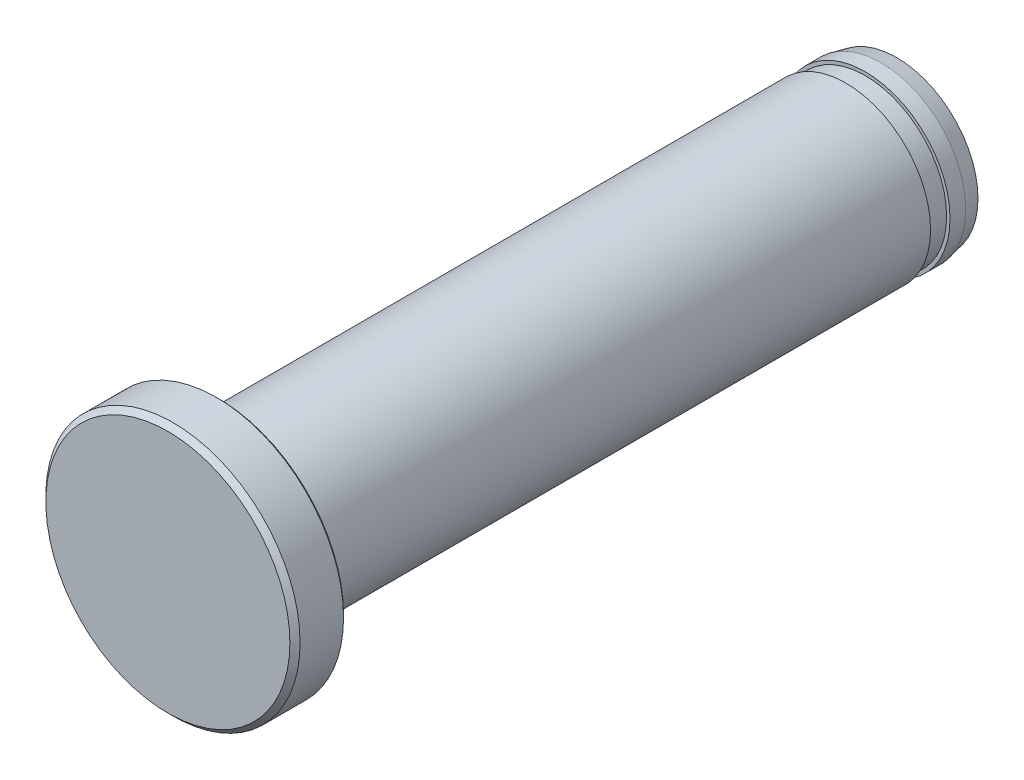
ISO-10303-21;
HEADER;
FILE_DESCRIPTION(('STEP AP214'),'2;1');
FILE_NAME('part.step','',(''),(''),'','','');
FILE_SCHEMA(('AUTOMOTIVE_DESIGN { 1 0 10303 214 1 1 1 1 }'));
ENDSEC;
DATA;
#1=APPLICATION_CONTEXT('core data for automotive mechanical design processes');
#2=APPLICATION_PROTOCOL_DEFINITION('international standard','automotive_design',2000,#1);
#3=PRODUCT_CONTEXT('',#1,'mechanical');
#4=PRODUCT('Part','Part','',(#3));
#5=PRODUCT_RELATED_PRODUCT_CATEGORY('part','',(#4));
#6=PRODUCT_DEFINITION_FORMATION('','',#4);
#7=PRODUCT_DEFINITION_CONTEXT('part definition',#1,'design');
#8=PRODUCT_DEFINITION('design','',#6,#7);
#9=PRODUCT_DEFINITION_SHAPE('','',#8);
#10=(LENGTH_UNIT() NAMED_UNIT(*) SI_UNIT(.MILLI.,.METRE.));
#11=(NAMED_UNIT(*) PLANE_ANGLE_UNIT() SI_UNIT($,.RADIAN.));
#12=(NAMED_UNIT(*) SI_UNIT($,.STERADIAN.) SOLID_ANGLE_UNIT());
#13=UNCERTAINTY_MEASURE_WITH_UNIT(LENGTH_MEASURE(1.E-05),#10,'distance_accuracy_value','');
#14=(GEOMETRIC_REPRESENTATION_CONTEXT(3) GLOBAL_UNCERTAINTY_ASSIGNED_CONTEXT((#13)) GLOBAL_UNIT_ASSIGNED_CONTEXT((#10,
#11,#12)) REPRESENTATION_CONTEXT('',''));
#15=CARTESIAN_POINT('',(0.,0.,0.));
#16=DIRECTION('',(0.,0.,1.));
#17=DIRECTION('',(1.,0.,0.));
#18=AXIS2_PLACEMENT_3D('',#15,#16,#17);
#19=CARTESIAN_POINT('',(0.,-7.2,21.5));
#20=DIRECTION('',(0.,0.,-1.));
#21=DIRECTION('',(-1.,0.,0.));
#22=AXIS2_PLACEMENT_3D('',#19,#20,#21);
#23=PLANE('',#22);
#24=CARTESIAN_POINT('',(0.,0.,21.5));
#25=DIRECTION('',(0.,0.,1.));
#26=DIRECTION('',(1.,0.,0.));
#27=AXIS2_PLACEMENT_3D('',#24,#25,#26);
#28=CIRCLE('',#27,7.2);
#29=CARTESIAN_POINT('',(7.2,0.,21.5));
#30=VERTEX_POINT('',#29);
#31=EDGE_CURVE('E74',#30,#30,#28,.T.);
#32=ORIENTED_EDGE('',*,*,#31,.T.);
#33=EDGE_LOOP('',(#32));
#34=FACE_BOUND('',#33,.T.);
#35=ADVANCED_FACE('F34',(#34),#23,.F.);
#36=CARTESIAN_POINT('',(0.,0.,-21.5));
#37=DIRECTION('',(0.,0.,1.));
#38=DIRECTION('',(1.,0.,0.));
#39=AXIS2_PLACEMENT_3D('',#36,#37,#38);
#40=PLANE('',#39);
#41=CARTESIAN_POINT('',(0.,0.,-21.5));
#42=DIRECTION('',(0.,0.,1.));
#43=DIRECTION('',(1.,0.,0.));
#44=AXIS2_PLACEMENT_3D('',#41,#42,#43);
#45=CIRCLE('',#44,4.8);
#46=CARTESIAN_POINT('',(4.8,0.,-21.5));
#47=VERTEX_POINT('',#46);
#48=EDGE_CURVE('E10',#47,#47,#45,.T.);
#49=ORIENTED_EDGE('',*,*,#48,.F.);
#50=EDGE_LOOP('',(#49));
#51=FACE_BOUND('',#50,.T.);
#52=ADVANCED_FACE('F140',(#51),#40,.F.);
#53=CARTESIAN_POINT('',(0.,0.,-21.5));
#54=DIRECTION('',(0.,0.,1.));
#55=DIRECTION('',(1.,0.,0.));
#56=AXIS2_PLACEMENT_3D('',#53,#54,#55);
#57=CONICAL_SURFACE('',#56,4.8,0.2129383495794);
#58=CARTESIAN_POINT('',(0.,0.,-20.575));
#59=DIRECTION('',(0.,0.,1.));
#60=DIRECTION('',(1.,0.,0.));
#61=AXIS2_PLACEMENT_3D('',#58,#59,#60);
#62=CIRCLE('',#61,5.);
#63=CARTESIAN_POINT('',(5.,0.,-20.575));
#64=VERTEX_POINT('',#63);
#65=EDGE_CURVE('E40',#64,#64,#62,.T.);
#66=ORIENTED_EDGE('',*,*,#65,.F.);
#67=EDGE_LOOP('',(#66));
#68=FACE_BOUND('',#67,.T.);
#69=ORIENTED_EDGE('',*,*,#48,.T.);
#70=EDGE_LOOP('',(#69));
#71=FACE_BOUND('',#70,.T.);
#72=ADVANCED_FACE('F135',(#68,#71),#57,.T.);
#73=CARTESIAN_POINT('',(0.,0.,21.5));
#74=DIRECTION('',(0.,0.,1.));
#75=DIRECTION('',(1.,0.,0.));
#76=AXIS2_PLACEMENT_3D('',#73,#74,#75);
#77=CYLINDRICAL_SURFACE('',#76,5.);
#78=CARTESIAN_POINT('',(0.,0.,-19.65));
#79=DIRECTION('',(0.,0.,1.));
#80=DIRECTION('',(1.,0.,0.));
#81=AXIS2_PLACEMENT_3D('',#78,#79,#80);
#82=CIRCLE('',#81,5.);
#83=CARTESIAN_POINT('',(5.,0.,-19.65));
#84=VERTEX_POINT('',#83);
#85=EDGE_CURVE('E44',#84,#84,#82,.T.);
#86=ORIENTED_EDGE('',*,*,#85,.F.);
#87=EDGE_LOOP('',(#86));
#88=FACE_BOUND('',#87,.T.);
#89=ORIENTED_EDGE('',*,*,#65,.T.);
#90=EDGE_LOOP('',(#89));
#91=FACE_BOUND('',#90,.T.);
#92=ADVANCED_FACE('F130',(#88,#91),#77,.T.);
#93=CARTESIAN_POINT('',(0.,-5.,-19.65));
#94=DIRECTION('',(0.,0.,-1.));
#95=DIRECTION('',(-1.,0.,0.));
#96=AXIS2_PLACEMENT_3D('',#93,#94,#95);
#97=PLANE('',#96);
#98=CARTESIAN_POINT('',(0.,0.,-19.65));
#99=DIRECTION('',(0.,0.,1.));
#100=DIRECTION('',(1.,0.,0.));
#101=AXIS2_PLACEMENT_3D('',#98,#99,#100);
#102=CIRCLE('',#101,4.8);
#103=CARTESIAN_POINT('',(4.8,0.,-19.65));
#104=VERTEX_POINT('',#103);
#105=EDGE_CURVE('E48',#104,#104,#102,.T.);
#106=ORIENTED_EDGE('',*,*,#105,.F.);
#107=EDGE_LOOP('',(#106));
#108=FACE_BOUND('',#107,.T.);
#109=ORIENTED_EDGE('',*,*,#85,.T.);
#110=EDGE_LOOP('',(#109));
#111=FACE_BOUND('',#110,.T.);
#112=ADVANCED_FACE('F124',(#108,#111),#97,.F.);
#113=CARTESIAN_POINT('',(0.,0.,21.5));
#114=DIRECTION('',(0.,0.,1.));
#115=DIRECTION('',(1.,0.,0.));
#116=AXIS2_PLACEMENT_3D('',#113,#114,#115);
#117=CYLINDRICAL_SURFACE('',#116,4.8);
#118=CARTESIAN_POINT('',(0.,0.,-18.5));
#119=DIRECTION('',(0.,0.,1.));
#120=DIRECTION('',(1.,0.,0.));
#121=AXIS2_PLACEMENT_3D('',#118,#119,#120);
#122=CIRCLE('',#121,4.8);
#123=CARTESIAN_POINT('',(4.8,0.,-18.5));
#124=VERTEX_POINT('',#123);
#125=EDGE_CURVE('E53',#124,#124,#122,.T.);
#126=ORIENTED_EDGE('',*,*,#125,.F.);
#127=EDGE_LOOP('',(#126));
#128=FACE_BOUND('',#127,.T.);
#129=ORIENTED_EDGE('',*,*,#105,.T.);
#130=EDGE_LOOP('',(#129));
#131=FACE_BOUND('',#130,.T.);
#132=ADVANCED_FACE('F118',(#128,#131),#117,.T.);
#133=CARTESIAN_POINT('',(0.,-4.8,-18.5));
#134=DIRECTION('',(0.,0.,1.));
#135=DIRECTION('',(1.,0.,0.));
#136=AXIS2_PLACEMENT_3D('',#133,#134,#135);
#137=PLANE('',#136);
#138=CARTESIAN_POINT('',(0.,0.,-18.5));
#139=DIRECTION('',(0.,0.,1.));
#140=DIRECTION('',(1.,0.,0.));
#141=AXIS2_PLACEMENT_3D('',#138,#139,#140);
#142=CIRCLE('',#141,5.);
#143=CARTESIAN_POINT('',(5.,0.,-18.5));
#144=VERTEX_POINT('',#143);
#145=EDGE_CURVE('E56',#144,#144,#142,.T.);
#146=ORIENTED_EDGE('',*,*,#145,.F.);
#147=EDGE_LOOP('',(#146));
#148=FACE_BOUND('',#147,.T.);
#149=ORIENTED_EDGE('',*,*,#125,.T.);
#150=EDGE_LOOP('',(#149));
#151=FACE_BOUND('',#150,.T.);
#152=ADVANCED_FACE('F112',(#148,#151),#137,.F.);
#153=CARTESIAN_POINT('',(0.,0.,21.5));
#154=DIRECTION('',(0.,0.,1.));
#155=DIRECTION('',(1.,0.,0.));
#156=AXIS2_PLACEMENT_3D('',#153,#154,#155);
#157=CYLINDRICAL_SURFACE('',#156,5.);
#158=CARTESIAN_POINT('',(0.,0.,18.3333333333333));
#159=DIRECTION('',(0.,0.,1.));
#160=DIRECTION('',(1.,0.,0.));
#161=AXIS2_PLACEMENT_3D('',#158,#159,#160);
#162=CIRCLE('',#161,5.);
#163=CARTESIAN_POINT('',(5.,0.,18.3333333333333));
#164=VERTEX_POINT('',#163);
#165=EDGE_CURVE('E59',#164,#164,#162,.T.);
#166=ORIENTED_EDGE('',*,*,#165,.F.);
#167=EDGE_LOOP('',(#166));
#168=FACE_BOUND('',#167,.T.);
#169=ORIENTED_EDGE('',*,*,#145,.T.);
#170=EDGE_LOOP('',(#169));
#171=FACE_BOUND('',#170,.T.);
#172=ADVANCED_FACE('F106',(#168,#171),#157,.T.);
#173=CARTESIAN_POINT('',(0.,0.,18.3333333333333));
#174=DIRECTION('',(0.,0.,1.));
#175=DIRECTION('',(1.,0.,0.));
#176=AXIS2_PLACEMENT_3D('',#173,#174,#175);
#177=TOROIDAL_SURFACE('',#176,5.16666666666666,0.166666666666667);
#178=CARTESIAN_POINT('',(0.,0.,18.5));
#179=DIRECTION('',(0.,0.,1.));
#180=DIRECTION('',(1.,0.,0.));
#181=AXIS2_PLACEMENT_3D('',#178,#179,#180);
#182=CIRCLE('',#181,5.16666666666666);
#183=CARTESIAN_POINT('',(5.16666666666666,0.,18.5));
#184=VERTEX_POINT('',#183);
#185=EDGE_CURVE('E62',#184,#184,#182,.T.);
#186=ORIENTED_EDGE('',*,*,#185,.F.);
#187=EDGE_LOOP('',(#186));
#188=FACE_BOUND('',#187,.T.);
#189=ORIENTED_EDGE('',*,*,#165,.T.);
#190=EDGE_LOOP('',(#189));
#191=FACE_BOUND('',#190,.T.);
#192=ADVANCED_FACE('F100',(#188,#191),#177,.F.);
#193=CARTESIAN_POINT('',(0.,-5.16666666666666,18.5));
#194=DIRECTION('',(0.,0.,1.));
#195=DIRECTION('',(1.,0.,0.));
#196=AXIS2_PLACEMENT_3D('',#193,#194,#195);
#197=PLANE('',#196);
#198=CARTESIAN_POINT('',(0.,0.,18.5));
#199=DIRECTION('',(0.,0.,1.));
#200=DIRECTION('',(1.,0.,0.));
#201=AXIS2_PLACEMENT_3D('',#198,#199,#200);
#202=CIRCLE('',#201,7.36666666666666);
#203=CARTESIAN_POINT('',(7.36666666666666,0.,18.5));
#204=VERTEX_POINT('',#203);
#205=EDGE_CURVE('E65',#204,#204,#202,.T.);
#206=ORIENTED_EDGE('',*,*,#205,.F.);
#207=EDGE_LOOP('',(#206));
#208=FACE_BOUND('',#207,.T.);
#209=ORIENTED_EDGE('',*,*,#185,.T.);
#210=EDGE_LOOP('',(#209));
#211=FACE_BOUND('',#210,.T.);
#212=ADVANCED_FACE('F94',(#208,#211),#197,.F.);
#213=CARTESIAN_POINT('',(0.,0.,18.5));
#214=DIRECTION('',(0.,0.,1.));
#215=DIRECTION('',(1.,0.,0.));
#216=AXIS2_PLACEMENT_3D('',#213,#214,#215);
#217=CONICAL_SURFACE('',#216,7.36666666666666,0.785398163397452);
#218=CARTESIAN_POINT('',(0.,0.,18.6333333333333));
#219=DIRECTION('',(0.,0.,1.));
#220=DIRECTION('',(1.,0.,0.));
#221=AXIS2_PLACEMENT_3D('',#218,#219,#220);
#222=CIRCLE('',#221,7.5);
#223=CARTESIAN_POINT('',(7.5,0.,18.6333333333333));
#224=VERTEX_POINT('',#223);
#225=EDGE_CURVE('E68',#224,#224,#222,.T.);
#226=ORIENTED_EDGE('',*,*,#225,.F.);
#227=EDGE_LOOP('',(#226));
#228=FACE_BOUND('',#227,.T.);
#229=ORIENTED_EDGE('',*,*,#205,.T.);
#230=EDGE_LOOP('',(#229));
#231=FACE_BOUND('',#230,.T.);
#232=ADVANCED_FACE('F88',(#228,#231),#217,.T.);
#233=CARTESIAN_POINT('',(0.,0.,21.5));
#234=DIRECTION('',(0.,0.,1.));
#235=DIRECTION('',(1.,0.,0.));
#236=AXIS2_PLACEMENT_3D('',#233,#234,#235);
#237=CYLINDRICAL_SURFACE('',#236,7.5);
#238=CARTESIAN_POINT('',(0.,0.,21.2));
#239=DIRECTION('',(0.,0.,1.));
#240=DIRECTION('',(1.,0.,0.));
#241=AXIS2_PLACEMENT_3D('',#238,#239,#240);
#242=CIRCLE('',#241,7.5);
#243=CARTESIAN_POINT('',(7.5,0.,21.2));
#244=VERTEX_POINT('',#243);
#245=EDGE_CURVE('E71',#244,#244,#242,.T.);
#246=ORIENTED_EDGE('',*,*,#245,.F.);
#247=EDGE_LOOP('',(#246));
#248=FACE_BOUND('',#247,.T.);
#249=ORIENTED_EDGE('',*,*,#225,.T.);
#250=EDGE_LOOP('',(#249));
#251=FACE_BOUND('',#250,.T.);
#252=ADVANCED_FACE('F82',(#248,#251),#237,.T.);
#253=CARTESIAN_POINT('',(0.,0.,21.2));
#254=DIRECTION('',(0.,0.,-1.));
#255=DIRECTION('',(-1.,0.,0.));
#256=AXIS2_PLACEMENT_3D('',#253,#254,#255);
#257=CONICAL_SURFACE('',#256,7.5,0.785398163397447);
#258=ORIENTED_EDGE('',*,*,#31,.F.);
#259=EDGE_LOOP('',(#258));
#260=FACE_BOUND('',#259,.T.);
#261=ORIENTED_EDGE('',*,*,#245,.T.);
#262=EDGE_LOOP('',(#261));
#263=FACE_BOUND('',#262,.T.);
#264=ADVANCED_FACE('F79',(#260,#263),#257,.T.);
#265=CLOSED_SHELL('',(#35,#52,#72,#92,#112,#132,#152,#172,#192,#212,#232,#252,#264));
#266=MANIFOLD_SOLID_BREP('B2',#265);
#267=ADVANCED_BREP_SHAPE_REPRESENTATION('',(#18,#266),#14);
#268=SHAPE_DEFINITION_REPRESENTATION(#9,#267);
ENDSEC;
END-ISO-10303-21;
